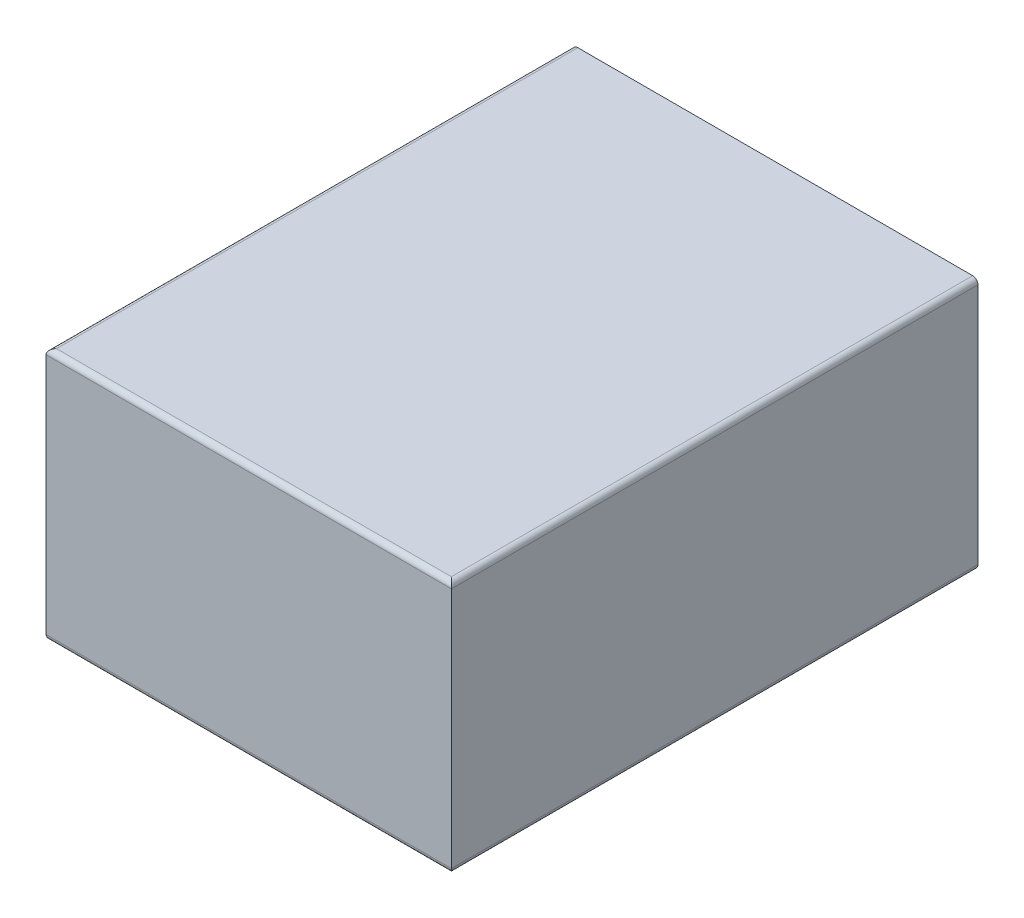
ISO-10303-21;
HEADER;
FILE_DESCRIPTION(('STEP AP214'),'2;1');
FILE_NAME('part.step','',(''),(''),'','','');
FILE_SCHEMA(('AUTOMOTIVE_DESIGN { 1 0 10303 214 1 1 1 1 }'));
ENDSEC;
DATA;
#1=APPLICATION_CONTEXT('core data for automotive mechanical design processes');
#2=APPLICATION_PROTOCOL_DEFINITION('international standard','automotive_design',2000,#1);
#3=PRODUCT_CONTEXT('',#1,'mechanical');
#4=PRODUCT('Part','Part','',(#3));
#5=PRODUCT_RELATED_PRODUCT_CATEGORY('part','',(#4));
#6=PRODUCT_DEFINITION_FORMATION('','',#4);
#7=PRODUCT_DEFINITION_CONTEXT('part definition',#1,'design');
#8=PRODUCT_DEFINITION('design','',#6,#7);
#9=PRODUCT_DEFINITION_SHAPE('','',#8);
#10=(LENGTH_UNIT() NAMED_UNIT(*) SI_UNIT(.MILLI.,.METRE.));
#11=(NAMED_UNIT(*) PLANE_ANGLE_UNIT() SI_UNIT($,.RADIAN.));
#12=(NAMED_UNIT(*) SI_UNIT($,.STERADIAN.) SOLID_ANGLE_UNIT());
#13=UNCERTAINTY_MEASURE_WITH_UNIT(LENGTH_MEASURE(1.E-05),#10,'distance_accuracy_value','');
#14=(GEOMETRIC_REPRESENTATION_CONTEXT(3) GLOBAL_UNCERTAINTY_ASSIGNED_CONTEXT((#13)) GLOBAL_UNIT_ASSIGNED_CONTEXT((#10,
#11,#12)) REPRESENTATION_CONTEXT('',''));
#15=CARTESIAN_POINT('',(0.,0.,0.));
#16=DIRECTION('',(0.,0.,1.));
#17=DIRECTION('',(1.,0.,0.));
#18=AXIS2_PLACEMENT_3D('',#15,#16,#17);
#19=CARTESIAN_POINT('',(385.,-240.,1000.));
#20=DIRECTION('',(-1.,0.,0.));
#21=DIRECTION('',(0.,0.,1.));
#22=AXIS2_PLACEMENT_3D('',#19,#20,#21);
#23=PLANE('',#22);
#24=DIRECTION('',(0.,1.,0.));
#25=VECTOR('',#24,1.);
#26=CARTESIAN_POINT('',(385.,-240.,1000.));
#27=LINE('',#26,#25);
#28=CARTESIAN_POINT('',(385.,-230.,1000.));
#29=VERTEX_POINT('',#28);
#30=CARTESIAN_POINT('',(385.,230.,1000.));
#31=VERTEX_POINT('',#30);
#32=EDGE_CURVE('E127',#29,#31,#27,.T.);
#33=ORIENTED_EDGE('',*,*,#32,.F.);
#34=DIRECTION('',(0.,0.,-1.));
#35=VECTOR('',#34,1.);
#36=CARTESIAN_POINT('',(385.,-230.,1000.));
#37=LINE('',#36,#35);
#38=CARTESIAN_POINT('',(385.,-230.,0.));
#39=VERTEX_POINT('',#38);
#40=EDGE_CURVE('E11',#29,#39,#37,.T.);
#41=ORIENTED_EDGE('',*,*,#40,.T.);
#42=DIRECTION('',(0.,1.,0.));
#43=VECTOR('',#42,1.);
#44=CARTESIAN_POINT('',(385.,-240.,0.));
#45=LINE('',#44,#43);
#46=CARTESIAN_POINT('',(385.,230.,0.));
#47=VERTEX_POINT('',#46);
#48=EDGE_CURVE('E141',#39,#47,#45,.T.);
#49=ORIENTED_EDGE('',*,*,#48,.T.);
#50=DIRECTION('',(0.,0.,-1.));
#51=VECTOR('',#50,1.);
#52=CARTESIAN_POINT('',(385.,230.,1000.));
#53=LINE('',#52,#51);
#54=EDGE_CURVE('E46',#47,#31,#53,.F.);
#55=ORIENTED_EDGE('',*,*,#54,.T.);
#56=EDGE_LOOP('',(#33,#41,#49,#55));
#57=FACE_BOUND('',#56,.T.);
#58=ADVANCED_FACE('F37',(#57),#23,.F.);
#59=CARTESIAN_POINT('',(-385.,240.,1000.));
#60=DIRECTION('',(0.,-1.,0.));
#61=DIRECTION('',(0.,0.,-1.));
#62=AXIS2_PLACEMENT_3D('',#59,#60,#61);
#63=PLANE('',#62);
#64=DIRECTION('',(-1.,0.,0.));
#65=VECTOR('',#64,1.);
#66=CARTESIAN_POINT('',(-385.,240.,0.));
#67=LINE('',#66,#65);
#68=CARTESIAN_POINT('',(375.,240.,0.));
#69=VERTEX_POINT('',#68);
#70=CARTESIAN_POINT('',(-375.,240.,0.));
#71=VERTEX_POINT('',#70);
#72=EDGE_CURVE('E143',#69,#71,#67,.T.);
#73=ORIENTED_EDGE('',*,*,#72,.T.);
#74=DIRECTION('',(0.,0.,-1.));
#75=VECTOR('',#74,1.);
#76=CARTESIAN_POINT('',(-375.,240.,1000.));
#77=LINE('',#76,#75);
#78=CARTESIAN_POINT('',(-375.,240.,990.));
#79=VERTEX_POINT('',#78);
#80=EDGE_CURVE('E153',#71,#79,#77,.F.);
#81=ORIENTED_EDGE('',*,*,#80,.T.);
#82=DIRECTION('',(-1.,0.,0.));
#83=VECTOR('',#82,1.);
#84=CARTESIAN_POINT('',(-385.,240.,990.));
#85=LINE('',#84,#83);
#86=CARTESIAN_POINT('',(375.,240.,990.));
#87=VERTEX_POINT('',#86);
#88=EDGE_CURVE('E151',#79,#87,#85,.F.);
#89=ORIENTED_EDGE('',*,*,#88,.T.);
#90=DIRECTION('',(0.,0.,-1.));
#91=VECTOR('',#90,1.);
#92=CARTESIAN_POINT('',(375.,240.,1000.));
#93=LINE('',#92,#91);
#94=EDGE_CURVE('E149',#87,#69,#93,.T.);
#95=ORIENTED_EDGE('',*,*,#94,.T.);
#96=EDGE_LOOP('',(#73,#81,#89,#95));
#97=FACE_BOUND('',#96,.T.);
#98=ADVANCED_FACE('F184',(#97),#63,.F.);
#99=CARTESIAN_POINT('',(-385.,-240.,1000.));
#100=DIRECTION('',(1.,0.,0.));
#101=DIRECTION('',(0.,0.,-1.));
#102=AXIS2_PLACEMENT_3D('',#99,#100,#101);
#103=PLANE('',#102);
#104=DIRECTION('',(0.,-1.,0.));
#105=VECTOR('',#104,1.);
#106=CARTESIAN_POINT('',(-385.,-240.,0.));
#107=LINE('',#106,#105);
#108=CARTESIAN_POINT('',(-385.,230.,0.));
#109=VERTEX_POINT('',#108);
#110=CARTESIAN_POINT('',(-385.,-230.,0.));
#111=VERTEX_POINT('',#110);
#112=EDGE_CURVE('E138',#109,#111,#107,.T.);
#113=ORIENTED_EDGE('',*,*,#112,.T.);
#114=DIRECTION('',(0.,0.,-1.));
#115=VECTOR('',#114,1.);
#116=CARTESIAN_POINT('',(-385.,-230.,1000.));
#117=LINE('',#116,#115);
#118=CARTESIAN_POINT('',(-385.,-230.,1000.));
#119=VERTEX_POINT('',#118);
#120=EDGE_CURVE('E167',#111,#119,#117,.F.);
#121=ORIENTED_EDGE('',*,*,#120,.T.);
#122=DIRECTION('',(0.,-1.,0.));
#123=VECTOR('',#122,1.);
#124=CARTESIAN_POINT('',(-385.,-240.,1000.));
#125=LINE('',#124,#123);
#126=CARTESIAN_POINT('',(-385.,230.,1000.));
#127=VERTEX_POINT('',#126);
#128=EDGE_CURVE('E129',#127,#119,#125,.T.);
#129=ORIENTED_EDGE('',*,*,#128,.F.);
#130=DIRECTION('',(0.,0.,-1.));
#131=VECTOR('',#130,1.);
#132=CARTESIAN_POINT('',(-385.,230.,1000.));
#133=LINE('',#132,#131);
#134=EDGE_CURVE('E61',#127,#109,#133,.T.);
#135=ORIENTED_EDGE('',*,*,#134,.T.);
#136=EDGE_LOOP('',(#113,#121,#129,#135));
#137=FACE_BOUND('',#136,.T.);
#138=ADVANCED_FACE('F190',(#137),#103,.F.);
#139=CARTESIAN_POINT('',(-385.,-240.,1000.));
#140=DIRECTION('',(0.,1.,0.));
#141=DIRECTION('',(0.,0.,1.));
#142=AXIS2_PLACEMENT_3D('',#139,#140,#141);
#143=PLANE('',#142);
#144=DIRECTION('',(1.,0.,0.));
#145=VECTOR('',#144,1.);
#146=CARTESIAN_POINT('',(-385.,-240.,990.));
#147=LINE('',#146,#145);
#148=CARTESIAN_POINT('',(375.,-240.,990.));
#149=VERTEX_POINT('',#148);
#150=CARTESIAN_POINT('',(-375.,-240.,990.));
#151=VERTEX_POINT('',#150);
#152=EDGE_CURVE('E112',#149,#151,#147,.F.);
#153=ORIENTED_EDGE('',*,*,#152,.T.);
#154=DIRECTION('',(0.,0.,-1.));
#155=VECTOR('',#154,1.);
#156=CARTESIAN_POINT('',(-375.,-240.,1000.));
#157=LINE('',#156,#155);
#158=CARTESIAN_POINT('',(-375.,-240.,0.));
#159=VERTEX_POINT('',#158);
#160=EDGE_CURVE('E158',#151,#159,#157,.T.);
#161=ORIENTED_EDGE('',*,*,#160,.T.);
#162=DIRECTION('',(1.,0.,0.));
#163=VECTOR('',#162,1.);
#164=CARTESIAN_POINT('',(-385.,-240.,0.));
#165=LINE('',#164,#163);
#166=CARTESIAN_POINT('',(375.,-240.,0.));
#167=VERTEX_POINT('',#166);
#168=EDGE_CURVE('E134',#159,#167,#165,.T.);
#169=ORIENTED_EDGE('',*,*,#168,.T.);
#170=DIRECTION('',(0.,0.,-1.));
#171=VECTOR('',#170,1.);
#172=CARTESIAN_POINT('',(375.,-240.,1000.));
#173=LINE('',#172,#171);
#174=EDGE_CURVE('E155',#167,#149,#173,.F.);
#175=ORIENTED_EDGE('',*,*,#174,.T.);
#176=EDGE_LOOP('',(#153,#161,#169,#175));
#177=FACE_BOUND('',#176,.T.);
#178=ADVANCED_FACE('F195',(#177),#143,.F.);
#179=CARTESIAN_POINT('',(0.,0.,1000.));
#180=DIRECTION('',(0.,0.,-1.));
#181=DIRECTION('',(-1.,0.,0.));
#182=AXIS2_PLACEMENT_3D('',#179,#180,#181);
#183=PLANE('',#182);
#184=ORIENTED_EDGE('',*,*,#32,.T.);
#185=DIRECTION('',(-1.,0.,0.));
#186=VECTOR('',#185,1.);
#187=CARTESIAN_POINT('',(0.,230.,1000.));
#188=LINE('',#187,#186);
#189=EDGE_CURVE('E131',#31,#127,#188,.T.);
#190=ORIENTED_EDGE('',*,*,#189,.T.);
#191=ORIENTED_EDGE('',*,*,#128,.T.);
#192=DIRECTION('',(1.,0.,0.));
#193=VECTOR('',#192,1.);
#194=CARTESIAN_POINT('',(0.,-230.,1000.));
#195=LINE('',#194,#193);
#196=EDGE_CURVE('E111',#119,#29,#195,.T.);
#197=ORIENTED_EDGE('',*,*,#196,.T.);
#198=EDGE_LOOP('',(#184,#190,#191,#197));
#199=FACE_BOUND('',#198,.T.);
#200=ADVANCED_FACE('F125',(#199),#183,.F.);
#201=CARTESIAN_POINT('',(0.,0.,0.));
#202=DIRECTION('',(0.,0.,-1.));
#203=DIRECTION('',(-1.,0.,0.));
#204=AXIS2_PLACEMENT_3D('',#201,#202,#203);
#205=PLANE('',#204);
#206=ORIENTED_EDGE('',*,*,#168,.F.);
#207=CARTESIAN_POINT('',(-375.,-230.,0.));
#208=DIRECTION('',(0.,0.,-1.));
#209=DIRECTION('',(-1.,0.,0.));
#210=AXIS2_PLACEMENT_3D('',#207,#208,#209);
#211=CIRCLE('',#210,10.);
#212=EDGE_CURVE('E54',#159,#111,#211,.T.);
#213=ORIENTED_EDGE('',*,*,#212,.T.);
#214=ORIENTED_EDGE('',*,*,#112,.F.);
#215=CARTESIAN_POINT('',(-375.,230.,0.));
#216=DIRECTION('',(0.,0.,-1.));
#217=DIRECTION('',(-1.,0.,0.));
#218=AXIS2_PLACEMENT_3D('',#215,#216,#217);
#219=CIRCLE('',#218,10.);
#220=EDGE_CURVE('E162',#109,#71,#219,.T.);
#221=ORIENTED_EDGE('',*,*,#220,.T.);
#222=ORIENTED_EDGE('',*,*,#72,.F.);
#223=CARTESIAN_POINT('',(375.,230.,0.));
#224=DIRECTION('',(0.,0.,-1.));
#225=DIRECTION('',(-1.,0.,0.));
#226=AXIS2_PLACEMENT_3D('',#223,#224,#225);
#227=CIRCLE('',#226,10.);
#228=EDGE_CURVE('E160',#69,#47,#227,.T.);
#229=ORIENTED_EDGE('',*,*,#228,.T.);
#230=ORIENTED_EDGE('',*,*,#48,.F.);
#231=CARTESIAN_POINT('',(375.,-230.,0.));
#232=DIRECTION('',(0.,0.,-1.));
#233=DIRECTION('',(-1.,0.,0.));
#234=AXIS2_PLACEMENT_3D('',#231,#232,#233);
#235=CIRCLE('',#234,10.);
#236=EDGE_CURVE('E117',#39,#167,#235,.T.);
#237=ORIENTED_EDGE('',*,*,#236,.T.);
#238=EDGE_LOOP('',(#206,#213,#214,#221,#222,#229,#230,#237));
#239=FACE_BOUND('',#238,.T.);
#240=ADVANCED_FACE('F186',(#239),#205,.T.);
#241=CARTESIAN_POINT('',(375.,230.,1000.));
#242=DIRECTION('',(0.,0.,-1.));
#243=DIRECTION('',(-1.,0.,0.));
#244=AXIS2_PLACEMENT_3D('',#241,#242,#243);
#245=CYLINDRICAL_SURFACE('',#244,10.);
#246=ORIENTED_EDGE('',*,*,#228,.F.);
#247=ORIENTED_EDGE('',*,*,#94,.F.);
#248=CARTESIAN_POINT('',(375.,230.,990.));
#249=DIRECTION('',(0.707106781186547,0.,-0.707106781186547));
#250=DIRECTION('',(-0.707106781186547,0.,-0.707106781186547));
#251=AXIS2_PLACEMENT_3D('',#248,#249,#250);
#252=ELLIPSE('',#251,14.1421356237309,10.);
#253=EDGE_CURVE('E144',#31,#87,#252,.F.);
#254=ORIENTED_EDGE('',*,*,#253,.F.);
#255=ORIENTED_EDGE('',*,*,#54,.F.);
#256=EDGE_LOOP('',(#246,#247,#254,#255));
#257=FACE_BOUND('',#256,.T.);
#258=ADVANCED_FACE('F181',(#257),#245,.T.);
#259=CARTESIAN_POINT('',(-375.,230.,1000.));
#260=DIRECTION('',(0.,0.,-1.));
#261=DIRECTION('',(-1.,0.,0.));
#262=AXIS2_PLACEMENT_3D('',#259,#260,#261);
#263=CYLINDRICAL_SURFACE('',#262,10.);
#264=ORIENTED_EDGE('',*,*,#220,.F.);
#265=ORIENTED_EDGE('',*,*,#134,.F.);
#266=CARTESIAN_POINT('',(-375.,230.,990.));
#267=DIRECTION('',(-0.707106781186547,0.,-0.707106781186547));
#268=DIRECTION('',(0.707106781186547,0.,-0.707106781186547));
#269=AXIS2_PLACEMENT_3D('',#266,#267,#268);
#270=ELLIPSE('',#269,14.1421356237309,10.);
#271=EDGE_CURVE('E170',#79,#127,#270,.F.);
#272=ORIENTED_EDGE('',*,*,#271,.F.);
#273=ORIENTED_EDGE('',*,*,#80,.F.);
#274=EDGE_LOOP('',(#264,#265,#272,#273));
#275=FACE_BOUND('',#274,.T.);
#276=ADVANCED_FACE('F189',(#275),#263,.T.);
#277=CARTESIAN_POINT('',(0.,230.,990.));
#278=DIRECTION('',(-1.,0.,0.));
#279=DIRECTION('',(0.,0.,1.));
#280=AXIS2_PLACEMENT_3D('',#277,#278,#279);
#281=CYLINDRICAL_SURFACE('',#280,10.);
#282=ORIENTED_EDGE('',*,*,#253,.T.);
#283=ORIENTED_EDGE('',*,*,#88,.F.);
#284=ORIENTED_EDGE('',*,*,#271,.T.);
#285=ORIENTED_EDGE('',*,*,#189,.F.);
#286=EDGE_LOOP('',(#282,#283,#284,#285));
#287=FACE_BOUND('',#286,.T.);
#288=ADVANCED_FACE('F176',(#287),#281,.T.);
#289=CARTESIAN_POINT('',(-375.,-230.,1000.));
#290=DIRECTION('',(0.,0.,-1.));
#291=DIRECTION('',(-1.,0.,0.));
#292=AXIS2_PLACEMENT_3D('',#289,#290,#291);
#293=CYLINDRICAL_SURFACE('',#292,10.);
#294=ORIENTED_EDGE('',*,*,#212,.F.);
#295=ORIENTED_EDGE('',*,*,#160,.F.);
#296=CARTESIAN_POINT('',(-375.,-230.,990.));
#297=DIRECTION('',(-0.707106781186547,0.,-0.707106781186547));
#298=DIRECTION('',(0.707106781186547,0.,-0.707106781186547));
#299=AXIS2_PLACEMENT_3D('',#296,#297,#298);
#300=ELLIPSE('',#299,14.1421356237309,10.);
#301=EDGE_CURVE('E41',#119,#151,#300,.F.);
#302=ORIENTED_EDGE('',*,*,#301,.F.);
#303=ORIENTED_EDGE('',*,*,#120,.F.);
#304=EDGE_LOOP('',(#294,#295,#302,#303));
#305=FACE_BOUND('',#304,.T.);
#306=ADVANCED_FACE('F39',(#305),#293,.T.);
#307=CARTESIAN_POINT('',(375.,-230.,1000.));
#308=DIRECTION('',(0.,0.,-1.));
#309=DIRECTION('',(-1.,0.,0.));
#310=AXIS2_PLACEMENT_3D('',#307,#308,#309);
#311=CYLINDRICAL_SURFACE('',#310,10.);
#312=ORIENTED_EDGE('',*,*,#236,.F.);
#313=ORIENTED_EDGE('',*,*,#40,.F.);
#314=CARTESIAN_POINT('',(375.,-230.,990.));
#315=DIRECTION('',(0.707106781186547,0.,-0.707106781186547));
#316=DIRECTION('',(-0.707106781186547,0.,-0.707106781186547));
#317=AXIS2_PLACEMENT_3D('',#314,#315,#316);
#318=ELLIPSE('',#317,14.1421356237309,10.);
#319=EDGE_CURVE('E106',#149,#29,#318,.F.);
#320=ORIENTED_EDGE('',*,*,#319,.F.);
#321=ORIENTED_EDGE('',*,*,#174,.F.);
#322=EDGE_LOOP('',(#312,#313,#320,#321));
#323=FACE_BOUND('',#322,.T.);
#324=ADVANCED_FACE('F116',(#323),#311,.T.);
#325=CARTESIAN_POINT('',(0.,-230.,990.));
#326=DIRECTION('',(1.,0.,0.));
#327=DIRECTION('',(0.,0.,-1.));
#328=AXIS2_PLACEMENT_3D('',#325,#326,#327);
#329=CYLINDRICAL_SURFACE('',#328,10.);
#330=ORIENTED_EDGE('',*,*,#301,.T.);
#331=ORIENTED_EDGE('',*,*,#152,.F.);
#332=ORIENTED_EDGE('',*,*,#319,.T.);
#333=ORIENTED_EDGE('',*,*,#196,.F.);
#334=EDGE_LOOP('',(#330,#331,#332,#333));
#335=FACE_BOUND('',#334,.T.);
#336=ADVANCED_FACE('F109',(#335),#329,.T.);
#337=CLOSED_SHELL('',(#58,#98,#138,#178,#200,#240,#258,#276,#288,#306,#324,#336));
#338=MANIFOLD_SOLID_BREP('B2',#337);
#339=ADVANCED_BREP_SHAPE_REPRESENTATION('',(#18,#338),#14);
#340=SHAPE_DEFINITION_REPRESENTATION(#9,#339);
ENDSEC;
END-ISO-10303-21;
